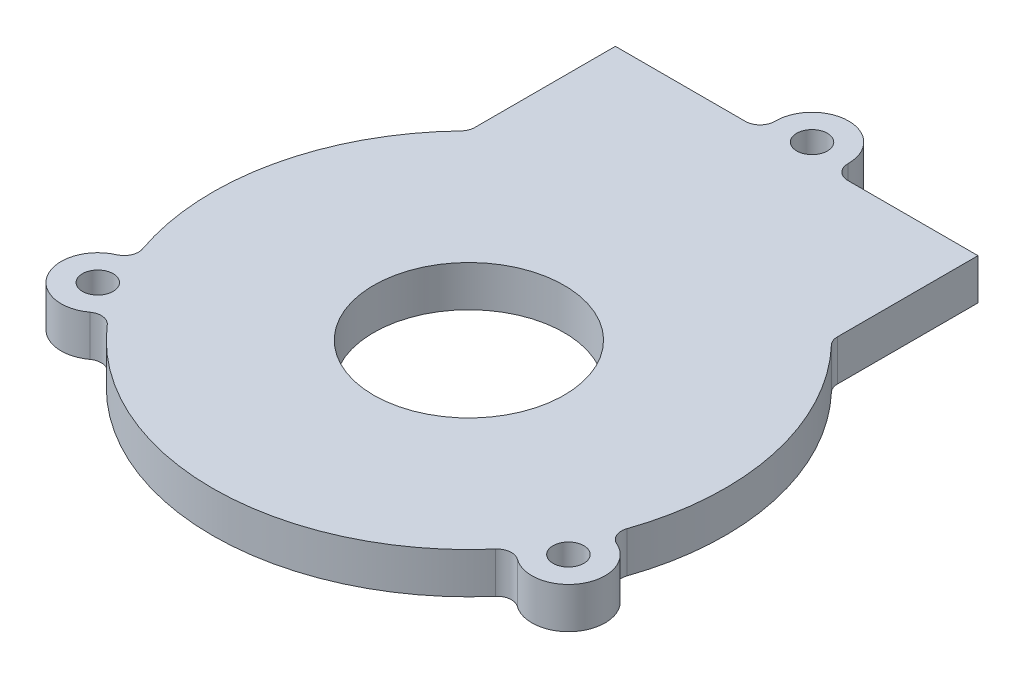
ISO-10303-21;
HEADER;
FILE_DESCRIPTION(('STEP AP214'),'2;1');
FILE_NAME('part.step','',(''),(''),'','','');
FILE_SCHEMA(('AUTOMOTIVE_DESIGN { 1 0 10303 214 1 1 1 1 }'));
ENDSEC;
DATA;
#1=APPLICATION_CONTEXT('core data for automotive mechanical design processes');
#2=APPLICATION_PROTOCOL_DEFINITION('international standard','automotive_design',2000,#1);
#3=PRODUCT_CONTEXT('',#1,'mechanical');
#4=PRODUCT('Part','Part','',(#3));
#5=PRODUCT_RELATED_PRODUCT_CATEGORY('part','',(#4));
#6=PRODUCT_DEFINITION_FORMATION('','',#4);
#7=PRODUCT_DEFINITION_CONTEXT('part definition',#1,'design');
#8=PRODUCT_DEFINITION('design','',#6,#7);
#9=PRODUCT_DEFINITION_SHAPE('','',#8);
#10=(LENGTH_UNIT() NAMED_UNIT(*) SI_UNIT(.MILLI.,.METRE.));
#11=(NAMED_UNIT(*) PLANE_ANGLE_UNIT() SI_UNIT($,.RADIAN.));
#12=(NAMED_UNIT(*) SI_UNIT($,.STERADIAN.) SOLID_ANGLE_UNIT());
#13=UNCERTAINTY_MEASURE_WITH_UNIT(LENGTH_MEASURE(1.E-05),#10,'distance_accuracy_value','');
#14=(GEOMETRIC_REPRESENTATION_CONTEXT(3) GLOBAL_UNCERTAINTY_ASSIGNED_CONTEXT((#13)) GLOBAL_UNIT_ASSIGNED_CONTEXT((#10,
#11,#12)) REPRESENTATION_CONTEXT('',''));
#15=CARTESIAN_POINT('',(0.,0.,0.));
#16=DIRECTION('',(0.,0.,1.));
#17=DIRECTION('',(1.,0.,0.));
#18=AXIS2_PLACEMENT_3D('',#15,#16,#17);
#19=CARTESIAN_POINT('',(0.,5.588,0.));
#20=DIRECTION('',(0.,-1.,0.));
#21=DIRECTION('',(0.,0.,-1.));
#22=AXIS2_PLACEMENT_3D('',#19,#20,#21);
#23=CYLINDRICAL_SURFACE('',#22,35.);
#24=CARTESIAN_POINT('',(0.,0.,0.));
#25=DIRECTION('',(0.,1.,0.));
#26=DIRECTION('',(0.,0.,1.));
#27=AXIS2_PLACEMENT_3D('',#24,#25,#26);
#28=CIRCLE('',#27,35.);
#29=CARTESIAN_POINT('',(-25.3019754085747,0.,-24.1828459951239));
#30=VERTEX_POINT('',#29);
#31=CARTESIAN_POINT('',(-33.072840065109,0.,11.4537002766671));
#32=VERTEX_POINT('',#31);
#33=EDGE_CURVE('E211',#30,#32,#28,.T.);
#34=ORIENTED_EDGE('',*,*,#33,.T.);
#35=DIRECTION('',(0.,-1.,0.));
#36=VECTOR('',#35,1.);
#37=CARTESIAN_POINT('',(-33.072840065109,5.588,11.4537002766671));
#38=LINE('',#37,#36);
#39=CARTESIAN_POINT('',(-33.072840065109,5.588,11.4537002766671));
#40=VERTEX_POINT('',#39);
#41=EDGE_CURVE('E224',#32,#40,#38,.F.);
#42=ORIENTED_EDGE('',*,*,#41,.T.);
#43=CARTESIAN_POINT('',(0.,5.588,0.));
#44=DIRECTION('',(0.,1.,0.));
#45=DIRECTION('',(0.,0.,1.));
#46=AXIS2_PLACEMENT_3D('',#43,#44,#45);
#47=CIRCLE('',#46,35.);
#48=CARTESIAN_POINT('',(-25.3019754085747,5.588,-24.1828459951239));
#49=VERTEX_POINT('',#48);
#50=EDGE_CURVE('E205',#49,#40,#47,.T.);
#51=ORIENTED_EDGE('',*,*,#50,.F.);
#52=DIRECTION('',(0.,-1.,0.));
#53=VECTOR('',#52,1.);
#54=CARTESIAN_POINT('',(-25.3019754085747,5.588,-24.1828459951239));
#55=LINE('',#54,#53);
#56=EDGE_CURVE('E218',#49,#30,#55,.T.);
#57=ORIENTED_EDGE('',*,*,#56,.T.);
#58=EDGE_LOOP('',(#34,#42,#51,#57));
#59=FACE_BOUND('',#58,.T.);
#60=ADVANCED_FACE('F43',(#59),#23,.T.);
#61=CARTESIAN_POINT('',(-26.5021889393046,0.,22.8611894140572));
#62=VERTEX_POINT('',#61);
#63=CARTESIAN_POINT('',(26.4887144081727,0.,22.8768006723464));
#64=VERTEX_POINT('',#63);
#65=EDGE_CURVE('E214',#62,#64,#28,.T.);
#66=ORIENTED_EDGE('',*,*,#65,.T.);
#67=DIRECTION('',(0.,-1.,0.));
#68=VECTOR('',#67,1.);
#69=CARTESIAN_POINT('',(26.4887144081727,5.588,22.8768006723464));
#70=LINE('',#69,#68);
#71=CARTESIAN_POINT('',(26.4887144081727,5.588,22.8768006723464));
#72=VERTEX_POINT('',#71);
#73=EDGE_CURVE('E243',#64,#72,#70,.F.);
#74=ORIENTED_EDGE('',*,*,#73,.T.);
#75=CARTESIAN_POINT('',(-26.5021889393046,5.588,22.8611894140572));
#76=VERTEX_POINT('',#75);
#77=EDGE_CURVE('E209',#76,#72,#47,.T.);
#78=ORIENTED_EDGE('',*,*,#77,.F.);
#79=DIRECTION('',(0.,-1.,0.));
#80=VECTOR('',#79,1.);
#81=CARTESIAN_POINT('',(-26.5021889393046,5.588,22.8611894140572));
#82=LINE('',#81,#80);
#83=EDGE_CURVE('E234',#76,#62,#82,.T.);
#84=ORIENTED_EDGE('',*,*,#83,.T.);
#85=EDGE_LOOP('',(#66,#74,#78,#84));
#86=FACE_BOUND('',#85,.T.);
#87=ADVANCED_FACE('F366',(#86),#23,.T.);
#88=CARTESIAN_POINT('',(-24.7478605121482,-53.381962685779,-44.7452325826062));
#89=DIRECTION('',(3.0206381024394E-06,0.,0.999999999995438));
#90=DIRECTION('',(0.999999999995438,0.,-3.0206381024394E-06));
#91=AXIS2_PLACEMENT_3D('',#88,#89,#90);
#92=PLANE('',#91);
#93=DIRECTION('',(0.999999999995438,0.,-3.0206381024394E-06));
#94=VECTOR('',#93,1.);
#95=CARTESIAN_POINT('',(-24.7478605121482,5.588,-44.7452325826062));
#96=LINE('',#95,#94);
#97=CARTESIAN_POINT('',(-24.7478605121482,5.588,-44.7452325826062));
#98=VERTEX_POINT('',#97);
#99=CARTESIAN_POINT('',(-6.99532394188785,5.588,-44.7452862065945));
#100=VERTEX_POINT('',#99);
#101=EDGE_CURVE('E177',#98,#100,#96,.T.);
#102=ORIENTED_EDGE('',*,*,#101,.T.);
#103=DIRECTION('',(0.,1.,0.));
#104=VECTOR('',#103,1.);
#105=CARTESIAN_POINT('',(-6.99532394188785,-53.381962685779,-44.7452862065945));
#106=LINE('',#105,#104);
#107=CARTESIAN_POINT('',(-6.99532394188785,0.,-44.7452862065945));
#108=VERTEX_POINT('',#107);
#109=EDGE_CURVE('E278',#100,#108,#106,.F.);
#110=ORIENTED_EDGE('',*,*,#109,.T.);
#111=DIRECTION('',(-0.999999999995438,0.,3.0206381024394E-06));
#112=VECTOR('',#111,1.);
#113=CARTESIAN_POINT('',(-24.7478605121482,0.,-44.7452325826062));
#114=LINE('',#113,#112);
#115=CARTESIAN_POINT('',(-24.7478605121482,0.,-44.7452325826062));
#116=VERTEX_POINT('',#115);
#117=EDGE_CURVE('E198',#108,#116,#114,.T.);
#118=ORIENTED_EDGE('',*,*,#117,.T.);
#119=DIRECTION('',(0.,1.,0.));
#120=VECTOR('',#119,1.);
#121=CARTESIAN_POINT('',(-24.7478605121482,-53.381962685779,-44.7452325826062));
#122=LINE('',#121,#120);
#123=EDGE_CURVE('E194',#116,#98,#122,.T.);
#124=ORIENTED_EDGE('',*,*,#123,.T.);
#125=EDGE_LOOP('',(#102,#110,#118,#124));
#126=FACE_BOUND('',#125,.T.);
#127=ADVANCED_FACE('F284',(#126),#92,.F.);
#128=CARTESIAN_POINT('',(33.0630730181294,0.,11.4818640733046));
#129=VERTEX_POINT('',#128);
#130=CARTESIAN_POINT('',(25.3018293128609,0.,-24.1829988509046));
#131=VERTEX_POINT('',#130);
#132=EDGE_CURVE('E215',#129,#131,#28,.T.);
#133=ORIENTED_EDGE('',*,*,#132,.T.);
#134=DIRECTION('',(0.,-1.,0.));
#135=VECTOR('',#134,1.);
#136=CARTESIAN_POINT('',(25.3018293128609,5.588,-24.1829988509046));
#137=LINE('',#136,#135);
#138=CARTESIAN_POINT('',(25.3018293128609,5.588,-24.1829988509046));
#139=VERTEX_POINT('',#138);
#140=EDGE_CURVE('E262',#131,#139,#137,.F.);
#141=ORIENTED_EDGE('',*,*,#140,.T.);
#142=CARTESIAN_POINT('',(33.0630730181294,5.588,11.4818640733046));
#143=VERTEX_POINT('',#142);
#144=EDGE_CURVE('E210',#143,#139,#47,.T.);
#145=ORIENTED_EDGE('',*,*,#144,.F.);
#146=DIRECTION('',(0.,-1.,0.));
#147=VECTOR('',#146,1.);
#148=CARTESIAN_POINT('',(33.0630730181294,5.588,11.4818640733046));
#149=LINE('',#148,#147);
#150=EDGE_CURVE('E253',#143,#129,#149,.T.);
#151=ORIENTED_EDGE('',*,*,#150,.T.);
#152=EDGE_LOOP('',(#133,#141,#145,#151));
#153=FACE_BOUND('',#152,.T.);
#154=ADVANCED_FACE('F343',(#153),#23,.T.);
#155=CARTESIAN_POINT('',(0.,5.588,0.));
#156=DIRECTION('',(0.,1.,0.));
#157=DIRECTION('',(0.,0.,1.));
#158=AXIS2_PLACEMENT_3D('',#155,#156,#157);
#159=PLANE('',#158);
#160=CARTESIAN_POINT('',(0.,5.588,0.));
#161=DIRECTION('',(0.,1.,0.));
#162=DIRECTION('',(0.,0.,1.));
#163=AXIS2_PLACEMENT_3D('',#160,#161,#162);
#164=CIRCLE('',#163,13.);
#165=CARTESIAN_POINT('',(0.,5.588,13.));
#166=VERTEX_POINT('',#165);
#167=EDGE_CURVE('E335',#166,#166,#164,.T.);
#168=ORIENTED_EDGE('',*,*,#167,.F.);
#169=EDGE_LOOP('',(#168));
#170=FACE_BOUND('',#169,.T.);
#171=CARTESIAN_POINT('',(-32.1480166138315,5.588,18.5087961651664));
#172=DIRECTION('',(0.,1.,0.));
#173=DIRECTION('',(0.,0.,1.));
#174=AXIS2_PLACEMENT_3D('',#171,#172,#173);
#175=CIRCLE('',#174,2.09999999999999);
#176=CARTESIAN_POINT('',(-32.1480166138315,5.588,20.6087961651664));
#177=VERTEX_POINT('',#176);
#178=EDGE_CURVE('E329',#177,#177,#175,.T.);
#179=ORIENTED_EDGE('',*,*,#178,.F.);
#180=EDGE_LOOP('',(#179));
#181=FACE_BOUND('',#180,.T.);
#182=DIRECTION('',(-3.02063810260161E-06,0.,-0.999999999995438));
#183=VECTOR('',#182,1.);
#184=CARTESIAN_POINT('',(-24.7478001128037,5.588,-24.7496745347634));
#185=LINE('',#184,#183);
#186=CARTESIAN_POINT('',(-24.7478025747881,5.588,-25.5647289504072));
#187=VERTEX_POINT('',#186);
#188=EDGE_CURVE('E195',#187,#98,#185,.T.);
#189=ORIENTED_EDGE('',*,*,#188,.F.);
#190=CARTESIAN_POINT('',(-26.747802574779,5.588,-25.564722909131));
#191=DIRECTION('',(0.,1.,0.));
#192=DIRECTION('',(0.,0.,1.));
#193=AXIS2_PLACEMENT_3D('',#190,#191,#192);
#194=CIRCLE('',#193,2.);
#195=EDGE_CURVE('E220',#187,#49,#194,.F.);
#196=ORIENTED_EDGE('',*,*,#195,.T.);
#197=ORIENTED_EDGE('',*,*,#50,.T.);
#198=CARTESIAN_POINT('',(-34.9627166402581,5.588,12.1081974353338));
#199=DIRECTION('',(0.,1.,0.));
#200=DIRECTION('',(0.,0.,1.));
#201=AXIS2_PLACEMENT_3D('',#198,#199,#200);
#202=CIRCLE('',#201,2.);
#203=CARTESIAN_POINT('',(-34.1580179965192,5.588,13.9391698799011));
#204=VERTEX_POINT('',#203);
#205=EDGE_CURVE('E230',#40,#204,#202,.F.);
#206=ORIENTED_EDGE('',*,*,#205,.T.);
#207=CARTESIAN_POINT('',(-32.1464555555357,5.588,18.5161819435163));
#208=DIRECTION('',(0.,1.,0.));
#209=DIRECTION('',(0.,0.,1.));
#210=AXIS2_PLACEMENT_3D('',#207,#208,#209);
#211=CIRCLE('',#210,4.99954226749351);
#212=CARTESIAN_POINT('',(-29.1966357044392,5.588,22.5527628891349));
#213=VERTEX_POINT('',#212);
#214=EDGE_CURVE('E323',#204,#213,#211,.T.);
#215=ORIENTED_EDGE('',*,*,#214,.T.);
#216=CARTESIAN_POINT('',(-28.0165997358363,5.588,24.1675430948605));
#217=DIRECTION('',(0.,1.,0.));
#218=DIRECTION('',(0.,0.,1.));
#219=AXIS2_PLACEMENT_3D('',#216,#217,#218);
#220=CIRCLE('',#219,2.);
#221=EDGE_CURVE('E241',#213,#76,#220,.F.);
#222=ORIENTED_EDGE('',*,*,#221,.T.);
#223=ORIENTED_EDGE('',*,*,#77,.T.);
#224=CARTESIAN_POINT('',(28.0023552314968,5.588,24.1840464250519));
#225=DIRECTION('',(0.,1.,0.));
#226=DIRECTION('',(0.,0.,1.));
#227=AXIS2_PLACEMENT_3D('',#224,#225,#226);
#228=CIRCLE('',#227,2.);
#229=CARTESIAN_POINT('',(29.184359284545,5.588,22.5707062815676));
#230=VERTEX_POINT('',#229);
#231=EDGE_CURVE('E249',#72,#230,#228,.F.);
#232=ORIENTED_EDGE('',*,*,#231,.T.);
#233=CARTESIAN_POINT('',(32.1364886347761,5.588,18.5412879583363));
#234=DIRECTION('',(0.,1.,0.));
#235=DIRECTION('',(0.,0.,1.));
#236=AXIS2_PLACEMENT_3D('',#233,#234,#235);
#237=CIRCLE('',#236,4.9951255964279);
#238=CARTESIAN_POINT('',(34.147287178261,5.588,13.9687647007018));
#239=VERTEX_POINT('',#238);
#240=EDGE_CURVE('E312',#230,#239,#237,.T.);
#241=ORIENTED_EDGE('',*,*,#240,.T.);
#242=CARTESIAN_POINT('',(34.9523914763083,5.588,12.1379705917791));
#243=DIRECTION('',(0.,1.,0.));
#244=DIRECTION('',(0.,0.,1.));
#245=AXIS2_PLACEMENT_3D('',#242,#243,#244);
#246=CIRCLE('',#245,2.);
#247=EDGE_CURVE('E260',#239,#143,#246,.F.);
#248=ORIENTED_EDGE('',*,*,#247,.T.);
#249=ORIENTED_EDGE('',*,*,#144,.T.);
#250=CARTESIAN_POINT('',(26.7476481307387,5.588,-25.5648844995277));
#251=DIRECTION('',(0.,1.,0.));
#252=DIRECTION('',(0.,0.,1.));
#253=AXIS2_PLACEMENT_3D('',#250,#251,#252);
#254=CIRCLE('',#253,2.);
#255=CARTESIAN_POINT('',(24.7476481307478,5.588,-25.5648784582515));
#256=VERTEX_POINT('',#255);
#257=EDGE_CURVE('E185',#139,#256,#254,.F.);
#258=ORIENTED_EDGE('',*,*,#257,.T.);
#259=DIRECTION('',(-3.02063810260161E-06,0.,-0.999999999995438));
#260=VECTOR('',#259,1.);
#261=CARTESIAN_POINT('',(24.7476505927322,5.588,-24.7498240426077));
#262=LINE('',#261,#260);
#263=CARTESIAN_POINT('',(24.7475901933877,5.588,-44.7453820904505));
#264=VERTEX_POINT('',#263);
#265=EDGE_CURVE('E178',#256,#264,#262,.T.);
#266=ORIENTED_EDGE('',*,*,#265,.T.);
#267=CARTESIAN_POINT('',(6.99533660471705,5.588,-44.7453284673169));
#268=VERTEX_POINT('',#267);
#269=EDGE_CURVE('E168',#268,#264,#96,.T.);
#270=ORIENTED_EDGE('',*,*,#269,.F.);
#271=CARTESIAN_POINT('',(6.99533056344084,5.588,-46.7453284673078));
#272=DIRECTION('',(0.,1.,0.));
#273=DIRECTION('',(0.,0.,1.));
#274=AXIS2_PLACEMENT_3D('',#271,#272,#273);
#275=CIRCLE('',#274,2.);
#276=CARTESIAN_POINT('',(4.99551899083441,5.588,-46.7727815922561));
#277=VERTEX_POINT('',#276);
#278=EDGE_CURVE('E274',#268,#277,#275,.F.);
#279=ORIENTED_EDGE('',*,*,#278,.T.);
#280=CARTESIAN_POINT('',(0.,5.588,-46.8413593567393));
#281=DIRECTION('',(0.,1.,0.));
#282=DIRECTION('',(0.,0.,1.));
#283=AXIS2_PLACEMENT_3D('',#280,#281,#282);
#284=CIRCLE('',#283,4.99598968149142);
#285=CARTESIAN_POINT('',(-4.99551857644603,5.588,-46.7727514129473));
#286=VERTEX_POINT('',#285);
#287=EDGE_CURVE('E304',#277,#286,#284,.T.);
#288=ORIENTED_EDGE('',*,*,#287,.T.);
#289=CARTESIAN_POINT('',(-6.99532998316405,5.588,-46.7452862065854));
#290=DIRECTION('',(0.,1.,0.));
#291=DIRECTION('',(0.,0.,1.));
#292=AXIS2_PLACEMENT_3D('',#289,#290,#291);
#293=CIRCLE('',#292,2.);
#294=EDGE_CURVE('E12',#286,#100,#293,.F.);
#295=ORIENTED_EDGE('',*,*,#294,.T.);
#296=ORIENTED_EDGE('',*,*,#101,.F.);
#297=EDGE_LOOP('',(#189,#196,#197,#206,#215,#222,#223,#232,#241,#248,#249,#258,#266,#270,#279,
#288,#295,#296));
#298=FACE_BOUND('',#297,.T.);
#299=CARTESIAN_POINT('',(32.1247811991366,5.588,18.5356173256723));
#300=DIRECTION('',(0.,1.,0.));
#301=DIRECTION('',(0.,0.,1.));
#302=AXIS2_PLACEMENT_3D('',#299,#300,#301);
#303=CIRCLE('',#302,2.1);
#304=CARTESIAN_POINT('',(32.1247811991366,5.588,20.6356173256723));
#305=VERTEX_POINT('',#304);
#306=EDGE_CURVE('E318',#305,#305,#303,.T.);
#307=ORIENTED_EDGE('',*,*,#306,.F.);
#308=EDGE_LOOP('',(#307));
#309=FACE_BOUND('',#308,.T.);
#310=CARTESIAN_POINT('',(0.,5.588,-46.8413593567393));
#311=DIRECTION('',(0.,1.,0.));
#312=DIRECTION('',(0.,0.,1.));
#313=AXIS2_PLACEMENT_3D('',#310,#311,#312);
#314=CIRCLE('',#313,2.09605202456873);
#315=CARTESIAN_POINT('',(0.,5.588,-44.7453073321706));
#316=VERTEX_POINT('',#315);
#317=EDGE_CURVE('E306',#316,#316,#314,.T.);
#318=ORIENTED_EDGE('',*,*,#317,.F.);
#319=EDGE_LOOP('',(#318));
#320=FACE_BOUND('',#319,.T.);
#321=ADVANCED_FACE('F182',(#170,#181,#298,#309,#320),#159,.T.);
#322=CARTESIAN_POINT('',(0.,0.,0.));
#323=DIRECTION('',(0.,1.,0.));
#324=DIRECTION('',(0.,0.,1.));
#325=AXIS2_PLACEMENT_3D('',#322,#323,#324);
#326=PLANE('',#325);
#327=CARTESIAN_POINT('',(0.,0.,0.));
#328=DIRECTION('',(0.,1.,0.));
#329=DIRECTION('',(0.,0.,1.));
#330=AXIS2_PLACEMENT_3D('',#327,#328,#329);
#331=CIRCLE('',#330,13.);
#332=CARTESIAN_POINT('',(0.,0.,13.));
#333=VERTEX_POINT('',#332);
#334=EDGE_CURVE('E332',#333,#333,#331,.F.);
#335=ORIENTED_EDGE('',*,*,#334,.F.);
#336=EDGE_LOOP('',(#335));
#337=FACE_BOUND('',#336,.T.);
#338=CARTESIAN_POINT('',(-32.1480166138315,0.,18.5087961651664));
#339=DIRECTION('',(0.,1.,0.));
#340=DIRECTION('',(0.,0.,1.));
#341=AXIS2_PLACEMENT_3D('',#338,#339,#340);
#342=CIRCLE('',#341,2.1);
#343=CARTESIAN_POINT('',(-32.1480166138315,0.,20.6087961651664));
#344=VERTEX_POINT('',#343);
#345=EDGE_CURVE('E326',#344,#344,#342,.T.);
#346=ORIENTED_EDGE('',*,*,#345,.T.);
#347=EDGE_LOOP('',(#346));
#348=FACE_BOUND('',#347,.T.);
#349=CARTESIAN_POINT('',(32.1247811991366,0.,18.5356173256723));
#350=DIRECTION('',(0.,1.,0.));
#351=DIRECTION('',(0.,0.,1.));
#352=AXIS2_PLACEMENT_3D('',#349,#350,#351);
#353=CIRCLE('',#352,2.1);
#354=CARTESIAN_POINT('',(32.1247811991366,0.,20.6356173256723));
#355=VERTEX_POINT('',#354);
#356=EDGE_CURVE('E315',#355,#355,#353,.T.);
#357=ORIENTED_EDGE('',*,*,#356,.T.);
#358=EDGE_LOOP('',(#357));
#359=FACE_BOUND('',#358,.T.);
#360=CARTESIAN_POINT('',(0.,0.,-46.8413593567393));
#361=DIRECTION('',(0.,1.,0.));
#362=DIRECTION('',(0.,0.,1.));
#363=AXIS2_PLACEMENT_3D('',#360,#361,#362);
#364=CIRCLE('',#363,2.09605202456873);
#365=CARTESIAN_POINT('',(0.,0.,-44.7453073321706));
#366=VERTEX_POINT('',#365);
#367=EDGE_CURVE('E188',#366,#366,#364,.F.);
#368=ORIENTED_EDGE('',*,*,#367,.F.);
#369=EDGE_LOOP('',(#368));
#370=FACE_BOUND('',#369,.T.);
#371=ORIENTED_EDGE('',*,*,#65,.F.);
#372=CARTESIAN_POINT('',(-28.0165997358363,0.,24.1675430948605));
#373=DIRECTION('',(0.,1.,0.));
#374=DIRECTION('',(0.,0.,1.));
#375=AXIS2_PLACEMENT_3D('',#372,#373,#374);
#376=CIRCLE('',#375,2.);
#377=CARTESIAN_POINT('',(-29.1966357044392,0.,22.5527628891349));
#378=VERTEX_POINT('',#377);
#379=EDGE_CURVE('E239',#62,#378,#376,.T.);
#380=ORIENTED_EDGE('',*,*,#379,.T.);
#381=CARTESIAN_POINT('',(-32.1464555555357,0.,18.5161819435163));
#382=DIRECTION('',(0.,1.,0.));
#383=DIRECTION('',(0.,0.,1.));
#384=AXIS2_PLACEMENT_3D('',#381,#382,#383);
#385=CIRCLE('',#384,4.99954226749351);
#386=CARTESIAN_POINT('',(-34.1580179965192,0.,13.9391698799011));
#387=VERTEX_POINT('',#386);
#388=EDGE_CURVE('E321',#378,#387,#385,.F.);
#389=ORIENTED_EDGE('',*,*,#388,.T.);
#390=CARTESIAN_POINT('',(-34.9627166402581,0.,12.1081974353338));
#391=DIRECTION('',(0.,1.,0.));
#392=DIRECTION('',(0.,0.,1.));
#393=AXIS2_PLACEMENT_3D('',#390,#391,#392);
#394=CIRCLE('',#393,2.);
#395=EDGE_CURVE('E232',#387,#32,#394,.T.);
#396=ORIENTED_EDGE('',*,*,#395,.T.);
#397=ORIENTED_EDGE('',*,*,#33,.F.);
#398=CARTESIAN_POINT('',(-26.747802574779,0.,-25.564722909131));
#399=DIRECTION('',(0.,1.,0.));
#400=DIRECTION('',(0.,0.,1.));
#401=AXIS2_PLACEMENT_3D('',#398,#399,#400);
#402=CIRCLE('',#401,2.);
#403=CARTESIAN_POINT('',(-24.7478025747881,0.,-25.5647289504072));
#404=VERTEX_POINT('',#403);
#405=EDGE_CURVE('E222',#30,#404,#402,.T.);
#406=ORIENTED_EDGE('',*,*,#405,.T.);
#407=DIRECTION('',(3.02063810260161E-06,0.,0.999999999995438));
#408=VECTOR('',#407,1.);
#409=CARTESIAN_POINT('',(-24.7478001128037,0.,-24.7496745347634));
#410=LINE('',#409,#408);
#411=EDGE_CURVE('E204',#116,#404,#410,.T.);
#412=ORIENTED_EDGE('',*,*,#411,.F.);
#413=ORIENTED_EDGE('',*,*,#117,.F.);
#414=CARTESIAN_POINT('',(-6.99532998316405,0.,-46.7452862065854));
#415=DIRECTION('',(0.,1.,0.));
#416=DIRECTION('',(0.,0.,1.));
#417=AXIS2_PLACEMENT_3D('',#414,#415,#416);
#418=CIRCLE('',#417,2.);
#419=CARTESIAN_POINT('',(-4.99551857644603,0.,-46.7727514129473));
#420=VERTEX_POINT('',#419);
#421=EDGE_CURVE('E51',#108,#420,#418,.T.);
#422=ORIENTED_EDGE('',*,*,#421,.T.);
#423=CARTESIAN_POINT('',(0.,0.,-46.8413593567393));
#424=DIRECTION('',(0.,1.,0.));
#425=DIRECTION('',(0.,0.,1.));
#426=AXIS2_PLACEMENT_3D('',#423,#424,#425);
#427=CIRCLE('',#426,4.99598968149142);
#428=CARTESIAN_POINT('',(4.99551899083441,0.,-46.7727815922561));
#429=VERTEX_POINT('',#428);
#430=EDGE_CURVE('E303',#420,#429,#427,.F.);
#431=ORIENTED_EDGE('',*,*,#430,.T.);
#432=CARTESIAN_POINT('',(6.99533056344084,0.,-46.7453284673078));
#433=DIRECTION('',(0.,1.,0.));
#434=DIRECTION('',(0.,0.,1.));
#435=AXIS2_PLACEMENT_3D('',#432,#433,#434);
#436=CIRCLE('',#435,2.);
#437=CARTESIAN_POINT('',(6.99533660471705,0.,-44.7453284673169));
#438=VERTEX_POINT('',#437);
#439=EDGE_CURVE('E276',#429,#438,#436,.T.);
#440=ORIENTED_EDGE('',*,*,#439,.T.);
#441=CARTESIAN_POINT('',(24.7475901933877,0.,-44.7453820904505));
#442=VERTEX_POINT('',#441);
#443=EDGE_CURVE('E202',#442,#438,#114,.T.);
#444=ORIENTED_EDGE('',*,*,#443,.F.);
#445=DIRECTION('',(3.02063810260161E-06,0.,0.999999999995438));
#446=VECTOR('',#445,1.);
#447=CARTESIAN_POINT('',(24.7476505927322,0.,-24.7498240426077));
#448=LINE('',#447,#446);
#449=CARTESIAN_POINT('',(24.7476481307478,0.,-25.5648784582515));
#450=VERTEX_POINT('',#449);
#451=EDGE_CURVE('E193',#442,#450,#448,.T.);
#452=ORIENTED_EDGE('',*,*,#451,.T.);
#453=CARTESIAN_POINT('',(26.7476481307387,0.,-25.5648844995277));
#454=DIRECTION('',(0.,1.,0.));
#455=DIRECTION('',(0.,0.,1.));
#456=AXIS2_PLACEMENT_3D('',#453,#454,#455);
#457=CIRCLE('',#456,2.);
#458=EDGE_CURVE('E268',#450,#131,#457,.T.);
#459=ORIENTED_EDGE('',*,*,#458,.T.);
#460=ORIENTED_EDGE('',*,*,#132,.F.);
#461=CARTESIAN_POINT('',(34.9523914763083,0.,12.1379705917791));
#462=DIRECTION('',(0.,1.,0.));
#463=DIRECTION('',(0.,0.,1.));
#464=AXIS2_PLACEMENT_3D('',#461,#462,#463);
#465=CIRCLE('',#464,2.);
#466=CARTESIAN_POINT('',(34.147287178261,0.,13.9687647007018));
#467=VERTEX_POINT('',#466);
#468=EDGE_CURVE('E258',#129,#467,#465,.T.);
#469=ORIENTED_EDGE('',*,*,#468,.T.);
#470=CARTESIAN_POINT('',(32.1364886347761,0.,18.5412879583363));
#471=DIRECTION('',(0.,1.,0.));
#472=DIRECTION('',(0.,0.,1.));
#473=AXIS2_PLACEMENT_3D('',#470,#471,#472);
#474=CIRCLE('',#473,4.9951255964279);
#475=CARTESIAN_POINT('',(29.184359284545,0.,22.5707062815676));
#476=VERTEX_POINT('',#475);
#477=EDGE_CURVE('E309',#467,#476,#474,.F.);
#478=ORIENTED_EDGE('',*,*,#477,.T.);
#479=CARTESIAN_POINT('',(28.0023552314968,0.,24.1840464250519));
#480=DIRECTION('',(0.,1.,0.));
#481=DIRECTION('',(0.,0.,1.));
#482=AXIS2_PLACEMENT_3D('',#479,#480,#481);
#483=CIRCLE('',#482,2.);
#484=EDGE_CURVE('E251',#476,#64,#483,.T.);
#485=ORIENTED_EDGE('',*,*,#484,.T.);
#486=EDGE_LOOP('',(#371,#380,#389,#396,#397,#406,#412,#413,#422,#431,#440,#444,#452,#459,#460,
#469,#478,#485));
#487=FACE_BOUND('',#486,.T.);
#488=ADVANCED_FACE('F290',(#337,#348,#359,#370,#487),#326,.F.);
#489=ORIENTED_EDGE('',*,*,#443,.T.);
#490=DIRECTION('',(0.,1.,0.));
#491=VECTOR('',#490,1.);
#492=CARTESIAN_POINT('',(6.99533660471704,-53.381962685779,-44.7453284673169));
#493=LINE('',#492,#491);
#494=EDGE_CURVE('E175',#438,#268,#493,.T.);
#495=ORIENTED_EDGE('',*,*,#494,.T.);
#496=ORIENTED_EDGE('',*,*,#269,.T.);
#497=DIRECTION('',(0.,1.,0.));
#498=VECTOR('',#497,1.);
#499=CARTESIAN_POINT('',(24.7475901933877,-53.381962685779,-44.7453820904505));
#500=LINE('',#499,#498);
#501=EDGE_CURVE('E173',#442,#264,#500,.T.);
#502=ORIENTED_EDGE('',*,*,#501,.F.);
#503=EDGE_LOOP('',(#489,#495,#496,#502));
#504=FACE_BOUND('',#503,.T.);
#505=ADVANCED_FACE('F171',(#504),#92,.F.);
#506=CARTESIAN_POINT('',(-24.7478001128037,-53.381962685779,-24.7496745347634));
#507=DIRECTION('',(0.999999999995438,0.,-3.02063810260161E-06));
#508=DIRECTION('',(-3.02063810260161E-06,0.,-0.999999999995438));
#509=AXIS2_PLACEMENT_3D('',#506,#507,#508);
#510=PLANE('',#509);
#511=ORIENTED_EDGE('',*,*,#411,.T.);
#512=DIRECTION('',(0.,1.,0.));
#513=VECTOR('',#512,1.);
#514=CARTESIAN_POINT('',(-24.7478025747881,5.588,-25.5647289504072));
#515=LINE('',#514,#513);
#516=EDGE_CURVE('E208',#404,#187,#515,.T.);
#517=ORIENTED_EDGE('',*,*,#516,.T.);
#518=ORIENTED_EDGE('',*,*,#188,.T.);
#519=ORIENTED_EDGE('',*,*,#123,.F.);
#520=EDGE_LOOP('',(#511,#517,#518,#519));
#521=FACE_BOUND('',#520,.T.);
#522=ADVANCED_FACE('F298',(#521),#510,.F.);
#523=CARTESIAN_POINT('',(24.7476505927322,-53.381962685779,-24.7498240426077));
#524=DIRECTION('',(0.999999999995438,0.,-3.02063810260161E-06));
#525=DIRECTION('',(-3.02063810260161E-06,0.,-0.999999999995438));
#526=AXIS2_PLACEMENT_3D('',#523,#524,#525);
#527=PLANE('',#526);
#528=ORIENTED_EDGE('',*,*,#265,.F.);
#529=DIRECTION('',(0.,-1.,0.));
#530=VECTOR('',#529,1.);
#531=CARTESIAN_POINT('',(24.7476481307478,-53.381962685779,-25.5648784582515));
#532=LINE('',#531,#530);
#533=EDGE_CURVE('E265',#256,#450,#532,.T.);
#534=ORIENTED_EDGE('',*,*,#533,.T.);
#535=ORIENTED_EDGE('',*,*,#451,.F.);
#536=ORIENTED_EDGE('',*,*,#501,.T.);
#537=EDGE_LOOP('',(#528,#534,#535,#536));
#538=FACE_BOUND('',#537,.T.);
#539=ADVANCED_FACE('F191',(#538),#527,.T.);
#540=CARTESIAN_POINT('',(0.,-14.1307927300824,-46.8413593567393));
#541=DIRECTION('',(0.,1.,0.));
#542=DIRECTION('',(0.,0.,1.));
#543=AXIS2_PLACEMENT_3D('',#540,#541,#542);
#544=CYLINDRICAL_SURFACE('',#543,4.99598968149142);
#545=ORIENTED_EDGE('',*,*,#430,.F.);
#546=DIRECTION('',(0.,1.,0.));
#547=VECTOR('',#546,1.);
#548=CARTESIAN_POINT('',(-4.99551857644604,-14.1307927300824,-46.7727514129473));
#549=LINE('',#548,#547);
#550=EDGE_CURVE('E64',#420,#286,#549,.T.);
#551=ORIENTED_EDGE('',*,*,#550,.T.);
#552=ORIENTED_EDGE('',*,*,#287,.F.);
#553=DIRECTION('',(0.,1.,0.));
#554=VECTOR('',#553,1.);
#555=CARTESIAN_POINT('',(4.99551899083441,-14.1307927300824,-46.7727815922561));
#556=LINE('',#555,#554);
#557=EDGE_CURVE('E271',#277,#429,#556,.F.);
#558=ORIENTED_EDGE('',*,*,#557,.T.);
#559=EDGE_LOOP('',(#545,#551,#552,#558));
#560=FACE_BOUND('',#559,.T.);
#561=ADVANCED_FACE('F392',(#560),#544,.T.);
#562=CARTESIAN_POINT('',(0.,-14.1307927300824,-46.8413593567393));
#563=DIRECTION('',(0.,1.,0.));
#564=DIRECTION('',(0.,0.,1.));
#565=AXIS2_PLACEMENT_3D('',#562,#563,#564);
#566=CYLINDRICAL_SURFACE('',#565,2.09605202456873);
#567=ORIENTED_EDGE('',*,*,#317,.T.);
#568=EDGE_LOOP('',(#567));
#569=FACE_BOUND('',#568,.T.);
#570=ORIENTED_EDGE('',*,*,#367,.T.);
#571=EDGE_LOOP('',(#570));
#572=FACE_BOUND('',#571,.T.);
#573=ADVANCED_FACE('F443',(#569,#572),#566,.F.);
#574=CARTESIAN_POINT('',(32.1364886347761,-14.1283487284507,18.5412879583363));
#575=DIRECTION('',(0.,1.,0.));
#576=DIRECTION('',(0.,0.,1.));
#577=AXIS2_PLACEMENT_3D('',#574,#575,#576);
#578=CYLINDRICAL_SURFACE('',#577,4.9951255964279);
#579=ORIENTED_EDGE('',*,*,#477,.F.);
#580=DIRECTION('',(0.,1.,0.));
#581=VECTOR('',#580,1.);
#582=CARTESIAN_POINT('',(34.147287178261,-14.1283487284507,13.9687647007018));
#583=LINE('',#582,#581);
#584=EDGE_CURVE('E256',#467,#239,#583,.T.);
#585=ORIENTED_EDGE('',*,*,#584,.T.);
#586=ORIENTED_EDGE('',*,*,#240,.F.);
#587=DIRECTION('',(0.,1.,0.));
#588=VECTOR('',#587,1.);
#589=CARTESIAN_POINT('',(29.184359284545,-14.1283487284507,22.5707062815676));
#590=LINE('',#589,#588);
#591=EDGE_CURVE('E246',#230,#476,#590,.F.);
#592=ORIENTED_EDGE('',*,*,#591,.T.);
#593=EDGE_LOOP('',(#579,#585,#586,#592));
#594=FACE_BOUND('',#593,.T.);
#595=ADVANCED_FACE('F438',(#594),#578,.T.);
#596=CARTESIAN_POINT('',(32.1247811991366,5.588,18.5356173256723));
#597=DIRECTION('',(0.,1.,0.));
#598=DIRECTION('',(0.,0.,1.));
#599=AXIS2_PLACEMENT_3D('',#596,#597,#598);
#600=CYLINDRICAL_SURFACE('',#599,2.1);
#601=ORIENTED_EDGE('',*,*,#356,.F.);
#602=EDGE_LOOP('',(#601));
#603=FACE_BOUND('',#602,.T.);
#604=ORIENTED_EDGE('',*,*,#306,.T.);
#605=EDGE_LOOP('',(#604));
#606=FACE_BOUND('',#605,.T.);
#607=ADVANCED_FACE('F360',(#603,#606),#600,.F.);
#608=CARTESIAN_POINT('',(-32.1464555555357,-14.1408409606937,18.5161819435163));
#609=DIRECTION('',(0.,1.,0.));
#610=DIRECTION('',(0.,0.,1.));
#611=AXIS2_PLACEMENT_3D('',#608,#609,#610);
#612=CYLINDRICAL_SURFACE('',#611,4.99954226749351);
#613=ORIENTED_EDGE('',*,*,#388,.F.);
#614=DIRECTION('',(0.,1.,0.));
#615=VECTOR('',#614,1.);
#616=CARTESIAN_POINT('',(-29.1966357044392,-14.1408409606937,22.5527628891349));
#617=LINE('',#616,#615);
#618=EDGE_CURVE('E237',#378,#213,#617,.T.);
#619=ORIENTED_EDGE('',*,*,#618,.T.);
#620=ORIENTED_EDGE('',*,*,#214,.F.);
#621=DIRECTION('',(0.,1.,0.));
#622=VECTOR('',#621,1.);
#623=CARTESIAN_POINT('',(-34.1580179965192,-14.1408409606937,13.9391698799011));
#624=LINE('',#623,#622);
#625=EDGE_CURVE('E227',#204,#387,#624,.F.);
#626=ORIENTED_EDGE('',*,*,#625,.T.);
#627=EDGE_LOOP('',(#613,#619,#620,#626));
#628=FACE_BOUND('',#627,.T.);
#629=ADVANCED_FACE('F350',(#628),#612,.T.);
#630=CARTESIAN_POINT('',(-32.1480166138315,5.588,18.5087961651664));
#631=DIRECTION('',(0.,1.,0.));
#632=DIRECTION('',(0.,0.,1.));
#633=AXIS2_PLACEMENT_3D('',#630,#631,#632);
#634=CYLINDRICAL_SURFACE('',#633,2.09999999999999);
#635=ORIENTED_EDGE('',*,*,#345,.F.);
#636=EDGE_LOOP('',(#635));
#637=FACE_BOUND('',#636,.T.);
#638=ORIENTED_EDGE('',*,*,#178,.T.);
#639=EDGE_LOOP('',(#638));
#640=FACE_BOUND('',#639,.T.);
#641=ADVANCED_FACE('F347',(#637,#640),#634,.F.);
#642=CARTESIAN_POINT('',(-26.747802574779,5.588,-25.564722909131));
#643=DIRECTION('',(0.,-1.,0.));
#644=DIRECTION('',(0.,0.,-1.));
#645=AXIS2_PLACEMENT_3D('',#642,#643,#644);
#646=CYLINDRICAL_SURFACE('',#645,2.);
#647=ORIENTED_EDGE('',*,*,#405,.F.);
#648=ORIENTED_EDGE('',*,*,#56,.F.);
#649=ORIENTED_EDGE('',*,*,#195,.F.);
#650=ORIENTED_EDGE('',*,*,#516,.F.);
#651=EDGE_LOOP('',(#647,#648,#649,#650));
#652=FACE_BOUND('',#651,.T.);
#653=ADVANCED_FACE('F349',(#652),#646,.F.);
#654=CARTESIAN_POINT('',(-34.9627166402581,-14.1408409606937,12.1081974353338));
#655=DIRECTION('',(0.,-1.,0.));
#656=DIRECTION('',(0.,0.,-1.));
#657=AXIS2_PLACEMENT_3D('',#654,#655,#656);
#658=CYLINDRICAL_SURFACE('',#657,2.);
#659=ORIENTED_EDGE('',*,*,#395,.F.);
#660=ORIENTED_EDGE('',*,*,#625,.F.);
#661=ORIENTED_EDGE('',*,*,#205,.F.);
#662=ORIENTED_EDGE('',*,*,#41,.F.);
#663=EDGE_LOOP('',(#659,#660,#661,#662));
#664=FACE_BOUND('',#663,.T.);
#665=ADVANCED_FACE('F357',(#664),#658,.F.);
#666=CARTESIAN_POINT('',(-28.0165997358363,-14.1408409606937,24.1675430948605));
#667=DIRECTION('',(0.,1.,0.));
#668=DIRECTION('',(0.,0.,1.));
#669=AXIS2_PLACEMENT_3D('',#666,#667,#668);
#670=CYLINDRICAL_SURFACE('',#669,2.);
#671=ORIENTED_EDGE('',*,*,#221,.F.);
#672=ORIENTED_EDGE('',*,*,#618,.F.);
#673=ORIENTED_EDGE('',*,*,#379,.F.);
#674=ORIENTED_EDGE('',*,*,#83,.F.);
#675=EDGE_LOOP('',(#671,#672,#673,#674));
#676=FACE_BOUND('',#675,.T.);
#677=ADVANCED_FACE('F411',(#676),#670,.F.);
#678=CARTESIAN_POINT('',(28.0023552314968,-14.1283487284507,24.1840464250519));
#679=DIRECTION('',(0.,-1.,0.));
#680=DIRECTION('',(0.,0.,-1.));
#681=AXIS2_PLACEMENT_3D('',#678,#679,#680);
#682=CYLINDRICAL_SURFACE('',#681,2.);
#683=ORIENTED_EDGE('',*,*,#484,.F.);
#684=ORIENTED_EDGE('',*,*,#591,.F.);
#685=ORIENTED_EDGE('',*,*,#231,.F.);
#686=ORIENTED_EDGE('',*,*,#73,.F.);
#687=EDGE_LOOP('',(#683,#684,#685,#686));
#688=FACE_BOUND('',#687,.T.);
#689=ADVANCED_FACE('F407',(#688),#682,.F.);
#690=CARTESIAN_POINT('',(34.9523914763083,-14.1283487284507,12.1379705917791));
#691=DIRECTION('',(0.,1.,0.));
#692=DIRECTION('',(0.,0.,1.));
#693=AXIS2_PLACEMENT_3D('',#690,#691,#692);
#694=CYLINDRICAL_SURFACE('',#693,2.);
#695=ORIENTED_EDGE('',*,*,#247,.F.);
#696=ORIENTED_EDGE('',*,*,#584,.F.);
#697=ORIENTED_EDGE('',*,*,#468,.F.);
#698=ORIENTED_EDGE('',*,*,#150,.F.);
#699=EDGE_LOOP('',(#695,#696,#697,#698));
#700=FACE_BOUND('',#699,.T.);
#701=ADVANCED_FACE('F402',(#700),#694,.F.);
#702=CARTESIAN_POINT('',(26.7476481307387,5.588,-25.5648844995277));
#703=DIRECTION('',(0.,-1.,0.));
#704=DIRECTION('',(0.,0.,-1.));
#705=AXIS2_PLACEMENT_3D('',#702,#703,#704);
#706=CYLINDRICAL_SURFACE('',#705,2.);
#707=ORIENTED_EDGE('',*,*,#458,.F.);
#708=ORIENTED_EDGE('',*,*,#533,.F.);
#709=ORIENTED_EDGE('',*,*,#257,.F.);
#710=ORIENTED_EDGE('',*,*,#140,.F.);
#711=EDGE_LOOP('',(#707,#708,#709,#710));
#712=FACE_BOUND('',#711,.T.);
#713=ADVANCED_FACE('F387',(#712),#706,.F.);
#714=CARTESIAN_POINT('',(6.99533056344084,-14.1307927300824,-46.7453284673078));
#715=DIRECTION('',(0.,1.,0.));
#716=DIRECTION('',(0.,0.,1.));
#717=AXIS2_PLACEMENT_3D('',#714,#715,#716);
#718=CYLINDRICAL_SURFACE('',#717,2.);
#719=ORIENTED_EDGE('',*,*,#439,.F.);
#720=ORIENTED_EDGE('',*,*,#557,.F.);
#721=ORIENTED_EDGE('',*,*,#278,.F.);
#722=ORIENTED_EDGE('',*,*,#494,.F.);
#723=EDGE_LOOP('',(#719,#720,#721,#722));
#724=FACE_BOUND('',#723,.T.);
#725=ADVANCED_FACE('F390',(#724),#718,.F.);
#726=CARTESIAN_POINT('',(-6.99532998316405,-14.1307927300824,-46.7452862065854));
#727=DIRECTION('',(0.,1.,0.));
#728=DIRECTION('',(0.,0.,1.));
#729=AXIS2_PLACEMENT_3D('',#726,#727,#728);
#730=CYLINDRICAL_SURFACE('',#729,2.);
#731=ORIENTED_EDGE('',*,*,#294,.F.);
#732=ORIENTED_EDGE('',*,*,#550,.F.);
#733=ORIENTED_EDGE('',*,*,#421,.F.);
#734=ORIENTED_EDGE('',*,*,#109,.F.);
#735=EDGE_LOOP('',(#731,#732,#733,#734));
#736=FACE_BOUND('',#735,.T.);
#737=ADVANCED_FACE('F45',(#736),#730,.F.);
#738=CARTESIAN_POINT('',(0.,-36.7695526217005,0.));
#739=DIRECTION('',(0.,1.,0.));
#740=DIRECTION('',(0.,0.,1.));
#741=AXIS2_PLACEMENT_3D('',#738,#739,#740);
#742=CYLINDRICAL_SURFACE('',#741,13.);
#743=ORIENTED_EDGE('',*,*,#334,.T.);
#744=EDGE_LOOP('',(#743));
#745=FACE_BOUND('',#744,.T.);
#746=ORIENTED_EDGE('',*,*,#167,.T.);
#747=EDGE_LOOP('',(#746));
#748=FACE_BOUND('',#747,.T.);
#749=ADVANCED_FACE('F339',(#745,#748),#742,.F.);
#750=CLOSED_SHELL('',(#60,#87,#127,#154,#321,#488,#505,#522,#539,#561,#573,#595,#607,#629,#641,
#653,#665,#677,#689,#701,#713,#725,#737,#749));
#751=MANIFOLD_SOLID_BREP('B2',#750);
#752=ADVANCED_BREP_SHAPE_REPRESENTATION('',(#18,#751),#14);
#753=SHAPE_DEFINITION_REPRESENTATION(#9,#752);
ENDSEC;
END-ISO-10303-21;
